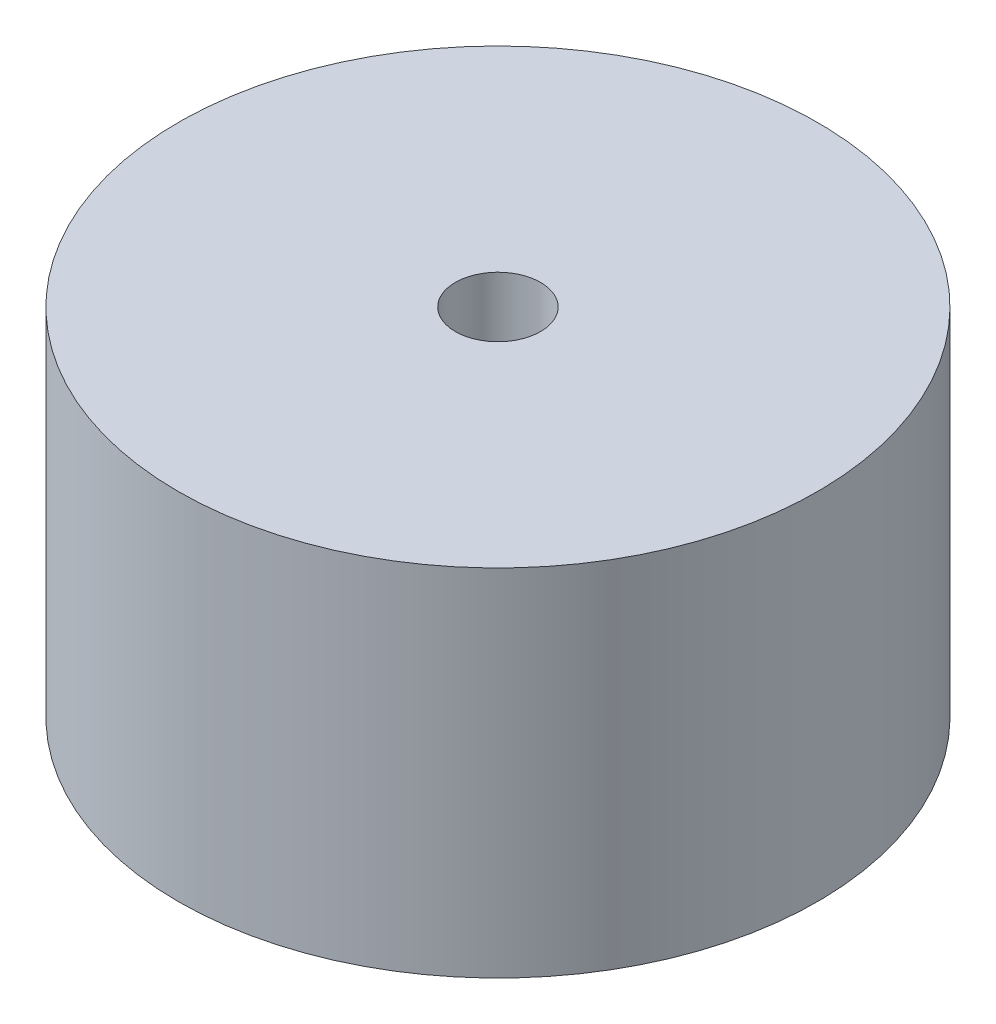
ISO-10303-21;
HEADER;
FILE_DESCRIPTION(('STEP AP214'),'2;1');
FILE_NAME('part.step','',(''),(''),'','','');
FILE_SCHEMA(('AUTOMOTIVE_DESIGN { 1 0 10303 214 1 1 1 1 }'));
ENDSEC;
DATA;
#1=APPLICATION_CONTEXT('core data for automotive mechanical design processes');
#2=APPLICATION_PROTOCOL_DEFINITION('international standard','automotive_design',2000,#1);
#3=PRODUCT_CONTEXT('',#1,'mechanical');
#4=PRODUCT('Part','Part','',(#3));
#5=PRODUCT_RELATED_PRODUCT_CATEGORY('part','',(#4));
#6=PRODUCT_DEFINITION_FORMATION('','',#4);
#7=PRODUCT_DEFINITION_CONTEXT('part definition',#1,'design');
#8=PRODUCT_DEFINITION('design','',#6,#7);
#9=PRODUCT_DEFINITION_SHAPE('','',#8);
#10=(LENGTH_UNIT() NAMED_UNIT(*) SI_UNIT(.MILLI.,.METRE.));
#11=(NAMED_UNIT(*) PLANE_ANGLE_UNIT() SI_UNIT($,.RADIAN.));
#12=(NAMED_UNIT(*) SI_UNIT($,.STERADIAN.) SOLID_ANGLE_UNIT());
#13=UNCERTAINTY_MEASURE_WITH_UNIT(LENGTH_MEASURE(1.E-05),#10,'distance_accuracy_value','');
#14=(GEOMETRIC_REPRESENTATION_CONTEXT(3) GLOBAL_UNCERTAINTY_ASSIGNED_CONTEXT((#13)) GLOBAL_UNIT_ASSIGNED_CONTEXT((#10,
#11,#12)) REPRESENTATION_CONTEXT('',''));
#15=CARTESIAN_POINT('',(0.,0.,0.));
#16=DIRECTION('',(0.,0.,1.));
#17=DIRECTION('',(1.,0.,0.));
#18=AXIS2_PLACEMENT_3D('',#15,#16,#17);
#19=CARTESIAN_POINT('',(0.,50.,0.));
#20=DIRECTION('',(0.,-1.,0.));
#21=DIRECTION('',(0.,0.,-1.));
#22=AXIS2_PLACEMENT_3D('',#19,#20,#21);
#23=CYLINDRICAL_SURFACE('',#22,45.);
#24=CARTESIAN_POINT('',(0.,50.,0.));
#25=DIRECTION('',(0.,1.,0.));
#26=DIRECTION('',(0.,0.,1.));
#27=AXIS2_PLACEMENT_3D('',#24,#25,#26);
#28=CIRCLE('',#27,45.);
#29=CARTESIAN_POINT('',(0.,50.,45.));
#30=VERTEX_POINT('',#29);
#31=EDGE_CURVE('E10',#30,#30,#28,.T.);
#32=ORIENTED_EDGE('',*,*,#31,.F.);
#33=EDGE_LOOP('',(#32));
#34=FACE_BOUND('',#33,.T.);
#35=CARTESIAN_POINT('',(0.,0.,0.));
#36=DIRECTION('',(0.,1.,0.));
#37=DIRECTION('',(0.,0.,1.));
#38=AXIS2_PLACEMENT_3D('',#35,#36,#37);
#39=CIRCLE('',#38,45.);
#40=CARTESIAN_POINT('',(0.,0.,45.));
#41=VERTEX_POINT('',#40);
#42=EDGE_CURVE('E46',#41,#41,#39,.T.);
#43=ORIENTED_EDGE('',*,*,#42,.T.);
#44=EDGE_LOOP('',(#43));
#45=FACE_BOUND('',#44,.T.);
#46=ADVANCED_FACE('F43',(#34,#45),#23,.T.);
#47=CARTESIAN_POINT('',(0.,50.,0.));
#48=DIRECTION('',(0.,1.,0.));
#49=DIRECTION('',(0.,0.,1.));
#50=AXIS2_PLACEMENT_3D('',#47,#48,#49);
#51=PLANE('',#50);
#52=CARTESIAN_POINT('',(0.,50.,0.));
#53=DIRECTION('',(0.,1.,0.));
#54=DIRECTION('',(0.,0.,1.));
#55=AXIS2_PLACEMENT_3D('',#52,#53,#54);
#56=CIRCLE('',#55,6.00000000000001);
#57=CARTESIAN_POINT('',(0.,50.,6.));
#58=VERTEX_POINT('',#57);
#59=EDGE_CURVE('E72',#58,#58,#56,.T.);
#60=ORIENTED_EDGE('',*,*,#59,.F.);
#61=EDGE_LOOP('',(#60));
#62=FACE_BOUND('',#61,.T.);
#63=ORIENTED_EDGE('',*,*,#31,.T.);
#64=EDGE_LOOP('',(#63));
#65=FACE_BOUND('',#64,.T.);
#66=ADVANCED_FACE('F79',(#62,#65),#51,.T.);
#67=CARTESIAN_POINT('',(0.,0.,0.));
#68=DIRECTION('',(0.,1.,0.));
#69=DIRECTION('',(0.,0.,1.));
#70=AXIS2_PLACEMENT_3D('',#67,#68,#69);
#71=PLANE('',#70);
#72=CARTESIAN_POINT('',(0.,0.,0.));
#73=DIRECTION('',(0.,1.,0.));
#74=DIRECTION('',(0.,0.,1.));
#75=AXIS2_PLACEMENT_3D('',#72,#73,#74);
#76=CIRCLE('',#75,40.);
#77=CARTESIAN_POINT('',(0.,0.,40.));
#78=VERTEX_POINT('',#77);
#79=EDGE_CURVE('E55',#78,#78,#76,.T.);
#80=ORIENTED_EDGE('',*,*,#79,.T.);
#81=EDGE_LOOP('',(#80));
#82=FACE_BOUND('',#81,.T.);
#83=ORIENTED_EDGE('',*,*,#42,.F.);
#84=EDGE_LOOP('',(#83));
#85=FACE_BOUND('',#84,.T.);
#86=ADVANCED_FACE('F81',(#82,#85),#71,.F.);
#87=CARTESIAN_POINT('',(0.,50.,0.));
#88=DIRECTION('',(0.,1.,0.));
#89=DIRECTION('',(0.,0.,1.));
#90=AXIS2_PLACEMENT_3D('',#87,#88,#89);
#91=CYLINDRICAL_SURFACE('',#90,40.);
#92=ORIENTED_EDGE('',*,*,#79,.F.);
#93=EDGE_LOOP('',(#92));
#94=FACE_BOUND('',#93,.T.);
#95=CARTESIAN_POINT('',(0.,9.99999999999988,0.));
#96=DIRECTION('',(0.,1.,0.));
#97=DIRECTION('',(0.,0.,1.));
#98=AXIS2_PLACEMENT_3D('',#95,#96,#97);
#99=CIRCLE('',#98,40.);
#100=CARTESIAN_POINT('',(0.,9.99999999999989,40.));
#101=VERTEX_POINT('',#100);
#102=EDGE_CURVE('E60',#101,#101,#99,.T.);
#103=ORIENTED_EDGE('',*,*,#102,.T.);
#104=EDGE_LOOP('',(#103));
#105=FACE_BOUND('',#104,.T.);
#106=ADVANCED_FACE('F87',(#94,#105),#91,.F.);
#107=CARTESIAN_POINT('',(0.,9.99999999999989,40.));
#108=DIRECTION('',(0.,1.,0.));
#109=DIRECTION('',(0.,0.,1.));
#110=AXIS2_PLACEMENT_3D('',#107,#108,#109);
#111=PLANE('',#110);
#112=ORIENTED_EDGE('',*,*,#102,.F.);
#113=EDGE_LOOP('',(#112));
#114=FACE_BOUND('',#113,.T.);
#115=CARTESIAN_POINT('',(0.,9.99999999999988,0.));
#116=DIRECTION('',(0.,1.,0.));
#117=DIRECTION('',(0.,0.,1.));
#118=AXIS2_PLACEMENT_3D('',#115,#116,#117);
#119=CIRCLE('',#118,37.);
#120=CARTESIAN_POINT('',(0.,9.9999999999999,37.));
#121=VERTEX_POINT('',#120);
#122=EDGE_CURVE('E64',#121,#121,#119,.T.);
#123=ORIENTED_EDGE('',*,*,#122,.T.);
#124=EDGE_LOOP('',(#123));
#125=FACE_BOUND('',#124,.T.);
#126=ADVANCED_FACE('F93',(#114,#125),#111,.F.);
#127=CARTESIAN_POINT('',(0.,41.,0.));
#128=DIRECTION('',(0.,-1.,0.));
#129=DIRECTION('',(0.,0.,-1.));
#130=AXIS2_PLACEMENT_3D('',#127,#128,#129);
#131=CONICAL_SURFACE('',#130,6.00000000000001,0.785398163397446);
#132=ORIENTED_EDGE('',*,*,#122,.F.);
#133=EDGE_LOOP('',(#132));
#134=FACE_BOUND('',#133,.T.);
#135=CARTESIAN_POINT('',(0.,41.,0.));
#136=DIRECTION('',(0.,1.,0.));
#137=DIRECTION('',(0.,0.,1.));
#138=AXIS2_PLACEMENT_3D('',#135,#136,#137);
#139=CIRCLE('',#138,6.00000000000001);
#140=CARTESIAN_POINT('',(0.,41.,6.));
#141=VERTEX_POINT('',#140);
#142=EDGE_CURVE('E68',#141,#141,#139,.T.);
#143=ORIENTED_EDGE('',*,*,#142,.T.);
#144=EDGE_LOOP('',(#143));
#145=FACE_BOUND('',#144,.T.);
#146=ADVANCED_FACE('F97',(#134,#145),#131,.F.);
#147=CARTESIAN_POINT('',(0.,50.,0.));
#148=DIRECTION('',(0.,1.,0.));
#149=DIRECTION('',(0.,0.,1.));
#150=AXIS2_PLACEMENT_3D('',#147,#148,#149);
#151=CYLINDRICAL_SURFACE('',#150,6.00000000000001);
#152=ORIENTED_EDGE('',*,*,#142,.F.);
#153=EDGE_LOOP('',(#152));
#154=FACE_BOUND('',#153,.T.);
#155=ORIENTED_EDGE('',*,*,#59,.T.);
#156=EDGE_LOOP('',(#155));
#157=FACE_BOUND('',#156,.T.);
#158=ADVANCED_FACE('F77',(#154,#157),#151,.F.);
#159=CLOSED_SHELL('',(#46,#66,#86,#106,#126,#146,#158));
#160=MANIFOLD_SOLID_BREP('B2',#159);
#161=ADVANCED_BREP_SHAPE_REPRESENTATION('',(#18,#160),#14);
#162=SHAPE_DEFINITION_REPRESENTATION(#9,#161);
ENDSEC;
END-ISO-10303-21;
